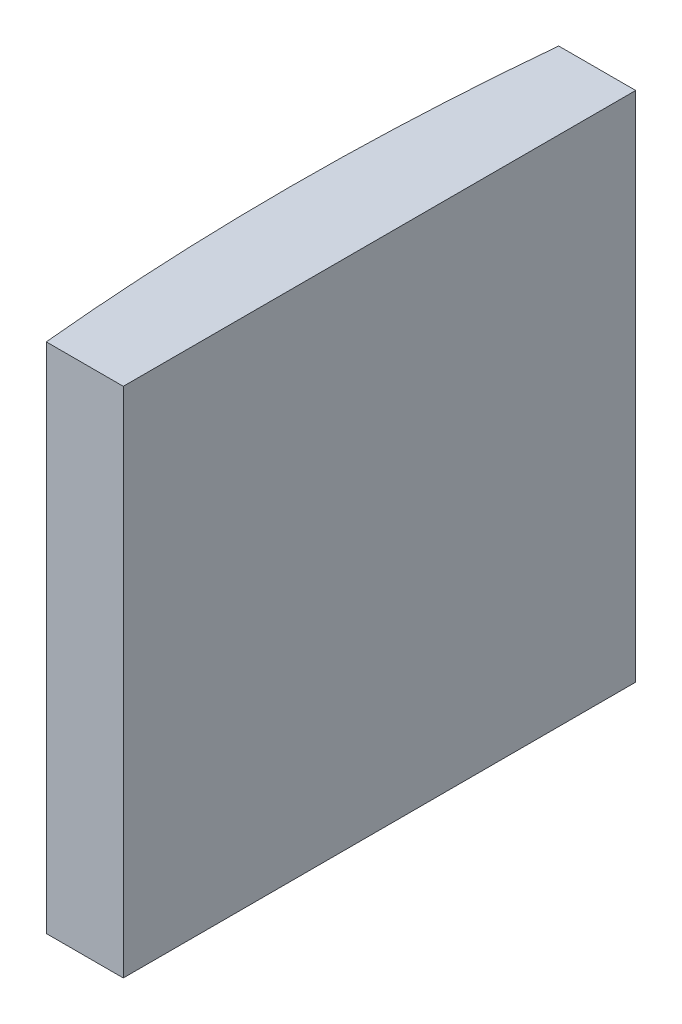
ISO-10303-21;
HEADER;
FILE_DESCRIPTION(('STEP AP214'),'2;1');
FILE_NAME('part.step','',(''),(''),'','','');
FILE_SCHEMA(('AUTOMOTIVE_DESIGN { 1 0 10303 214 1 1 1 1 }'));
ENDSEC;
DATA;
#1=APPLICATION_CONTEXT('core data for automotive mechanical design processes');
#2=APPLICATION_PROTOCOL_DEFINITION('international standard','automotive_design',2000,#1);
#3=PRODUCT_CONTEXT('',#1,'mechanical');
#4=PRODUCT('Part','Part','',(#3));
#5=PRODUCT_RELATED_PRODUCT_CATEGORY('part','',(#4));
#6=PRODUCT_DEFINITION_FORMATION('','',#4);
#7=PRODUCT_DEFINITION_CONTEXT('part definition',#1,'design');
#8=PRODUCT_DEFINITION('design','',#6,#7);
#9=PRODUCT_DEFINITION_SHAPE('','',#8);
#10=(LENGTH_UNIT() NAMED_UNIT(*) SI_UNIT(.MILLI.,.METRE.));
#11=(NAMED_UNIT(*) PLANE_ANGLE_UNIT() SI_UNIT($,.RADIAN.));
#12=(NAMED_UNIT(*) SI_UNIT($,.STERADIAN.) SOLID_ANGLE_UNIT());
#13=UNCERTAINTY_MEASURE_WITH_UNIT(LENGTH_MEASURE(1.E-05),#10,'distance_accuracy_value','');
#14=(GEOMETRIC_REPRESENTATION_CONTEXT(3) GLOBAL_UNCERTAINTY_ASSIGNED_CONTEXT((#13)) GLOBAL_UNIT_ASSIGNED_CONTEXT((#10,
#11,#12)) REPRESENTATION_CONTEXT('',''));
#15=CARTESIAN_POINT('',(0.,0.,0.));
#16=DIRECTION('',(0.,0.,1.));
#17=DIRECTION('',(1.,0.,0.));
#18=AXIS2_PLACEMENT_3D('',#15,#16,#17);
#19=CARTESIAN_POINT('',(4.35520433485127,20.,0.));
#20=DIRECTION('',(0.,-1.,0.));
#21=DIRECTION('',(0.,0.,-1.));
#22=AXIS2_PLACEMENT_3D('',#19,#20,#21);
#23=CYLINDRICAL_SURFACE('',#22,103.4);
#24=CARTESIAN_POINT('',(4.35520433485127,0.,0.));
#25=DIRECTION('',(0.,1.,0.));
#26=DIRECTION('',(0.,0.,1.));
#27=AXIS2_PLACEMENT_3D('',#24,#25,#26);
#28=CIRCLE('',#27,103.4);
#29=CARTESIAN_POINT('',(-98.560100649393,0.,-10.));
#30=VERTEX_POINT('',#29);
#31=CARTESIAN_POINT('',(-98.560100649393,0.,10.));
#32=VERTEX_POINT('',#31);
#33=EDGE_CURVE('E100',#30,#32,#28,.T.);
#34=ORIENTED_EDGE('',*,*,#33,.T.);
#35=DIRECTION('',(0.,-1.,0.));
#36=VECTOR('',#35,1.);
#37=CARTESIAN_POINT('',(-98.560100649393,20.,10.));
#38=LINE('',#37,#36);
#39=CARTESIAN_POINT('',(-98.560100649393,20.,10.));
#40=VERTEX_POINT('',#39);
#41=EDGE_CURVE('E11',#40,#32,#38,.T.);
#42=ORIENTED_EDGE('',*,*,#41,.F.);
#43=CARTESIAN_POINT('',(4.35520433485127,20.,0.));
#44=DIRECTION('',(0.,1.,0.));
#45=DIRECTION('',(0.,0.,1.));
#46=AXIS2_PLACEMENT_3D('',#43,#44,#45);
#47=CIRCLE('',#46,103.4);
#48=CARTESIAN_POINT('',(-98.560100649393,20.,-10.));
#49=VERTEX_POINT('',#48);
#50=EDGE_CURVE('E88',#49,#40,#47,.T.);
#51=ORIENTED_EDGE('',*,*,#50,.F.);
#52=DIRECTION('',(0.,-1.,0.));
#53=VECTOR('',#52,1.);
#54=CARTESIAN_POINT('',(-98.560100649393,20.,-10.));
#55=LINE('',#54,#53);
#56=EDGE_CURVE('E96',#49,#30,#55,.T.);
#57=ORIENTED_EDGE('',*,*,#56,.T.);
#58=EDGE_LOOP('',(#34,#42,#51,#57));
#59=FACE_BOUND('',#58,.T.);
#60=ADVANCED_FACE('F37',(#59),#23,.T.);
#61=CARTESIAN_POINT('',(-98.560100649393,20.,10.));
#62=DIRECTION('',(0.,0.,-1.));
#63=DIRECTION('',(-1.,0.,0.));
#64=AXIS2_PLACEMENT_3D('',#61,#62,#63);
#65=PLANE('',#64);
#66=DIRECTION('',(1.,0.,0.));
#67=VECTOR('',#66,1.);
#68=CARTESIAN_POINT('',(-98.560100649393,0.,10.));
#69=LINE('',#68,#67);
#70=CARTESIAN_POINT('',(-95.5547956651487,0.,10.));
#71=VERTEX_POINT('',#70);
#72=EDGE_CURVE('E92',#32,#71,#69,.T.);
#73=ORIENTED_EDGE('',*,*,#72,.T.);
#74=DIRECTION('',(0.,-1.,0.));
#75=VECTOR('',#74,1.);
#76=CARTESIAN_POINT('',(-95.5547956651487,20.,10.));
#77=LINE('',#76,#75);
#78=CARTESIAN_POINT('',(-95.5547956651487,20.,10.));
#79=VERTEX_POINT('',#78);
#80=EDGE_CURVE('E45',#79,#71,#77,.T.);
#81=ORIENTED_EDGE('',*,*,#80,.F.);
#82=DIRECTION('',(1.,0.,0.));
#83=VECTOR('',#82,1.);
#84=CARTESIAN_POINT('',(-98.560100649393,20.,10.));
#85=LINE('',#84,#83);
#86=EDGE_CURVE('E83',#40,#79,#85,.T.);
#87=ORIENTED_EDGE('',*,*,#86,.F.);
#88=ORIENTED_EDGE('',*,*,#41,.T.);
#89=EDGE_LOOP('',(#73,#81,#87,#88));
#90=FACE_BOUND('',#89,.T.);
#91=ADVANCED_FACE('F91',(#90),#65,.F.);
#92=CARTESIAN_POINT('',(-95.5547956651487,20.,-9.99999999999999));
#93=DIRECTION('',(-1.,0.,0.));
#94=DIRECTION('',(0.,0.,1.));
#95=AXIS2_PLACEMENT_3D('',#92,#93,#94);
#96=PLANE('',#95);
#97=DIRECTION('',(0.,0.,-1.));
#98=VECTOR('',#97,1.);
#99=CARTESIAN_POINT('',(-95.5547956651487,0.,-9.99999999999999));
#100=LINE('',#99,#98);
#101=CARTESIAN_POINT('',(-95.5547956651487,0.,-9.99999999999999));
#102=VERTEX_POINT('',#101);
#103=EDGE_CURVE('E70',#71,#102,#100,.T.);
#104=ORIENTED_EDGE('',*,*,#103,.T.);
#105=DIRECTION('',(0.,-1.,0.));
#106=VECTOR('',#105,1.);
#107=CARTESIAN_POINT('',(-95.5547956651487,20.,-9.99999999999999));
#108=LINE('',#107,#106);
#109=CARTESIAN_POINT('',(-95.5547956651487,20.,-9.99999999999999));
#110=VERTEX_POINT('',#109);
#111=EDGE_CURVE('E93',#110,#102,#108,.T.);
#112=ORIENTED_EDGE('',*,*,#111,.F.);
#113=DIRECTION('',(0.,0.,-1.));
#114=VECTOR('',#113,1.);
#115=CARTESIAN_POINT('',(-95.5547956651487,20.,-9.99999999999999));
#116=LINE('',#115,#114);
#117=EDGE_CURVE('E86',#79,#110,#116,.T.);
#118=ORIENTED_EDGE('',*,*,#117,.F.);
#119=ORIENTED_EDGE('',*,*,#80,.T.);
#120=EDGE_LOOP('',(#104,#112,#118,#119));
#121=FACE_BOUND('',#120,.T.);
#122=ADVANCED_FACE('F94',(#121),#96,.F.);
#123=CARTESIAN_POINT('',(-98.560100649393,20.,-10.));
#124=DIRECTION('',(0.,0.,1.));
#125=DIRECTION('',(1.,0.,0.));
#126=AXIS2_PLACEMENT_3D('',#123,#124,#125);
#127=PLANE('',#126);
#128=DIRECTION('',(-1.,0.,0.));
#129=VECTOR('',#128,1.);
#130=CARTESIAN_POINT('',(-98.560100649393,0.,-10.));
#131=LINE('',#130,#129);
#132=EDGE_CURVE('E76',#102,#30,#131,.T.);
#133=ORIENTED_EDGE('',*,*,#132,.T.);
#134=ORIENTED_EDGE('',*,*,#56,.F.);
#135=DIRECTION('',(-1.,0.,0.));
#136=VECTOR('',#135,1.);
#137=CARTESIAN_POINT('',(-98.560100649393,20.,-10.));
#138=LINE('',#137,#136);
#139=EDGE_CURVE('E53',#110,#49,#138,.T.);
#140=ORIENTED_EDGE('',*,*,#139,.F.);
#141=ORIENTED_EDGE('',*,*,#111,.T.);
#142=EDGE_LOOP('',(#133,#134,#140,#141));
#143=FACE_BOUND('',#142,.T.);
#144=ADVANCED_FACE('F107',(#143),#127,.F.);
#145=CARTESIAN_POINT('',(4.35520433485127,20.,0.));
#146=DIRECTION('',(0.,1.,0.));
#147=DIRECTION('',(0.,0.,1.));
#148=AXIS2_PLACEMENT_3D('',#145,#146,#147);
#149=PLANE('',#148);
#150=ORIENTED_EDGE('',*,*,#50,.T.);
#151=ORIENTED_EDGE('',*,*,#86,.T.);
#152=ORIENTED_EDGE('',*,*,#117,.T.);
#153=ORIENTED_EDGE('',*,*,#139,.T.);
#154=EDGE_LOOP('',(#150,#151,#152,#153));
#155=FACE_BOUND('',#154,.T.);
#156=ADVANCED_FACE('F84',(#155),#149,.T.);
#157=CARTESIAN_POINT('',(4.35520433485127,0.,0.));
#158=DIRECTION('',(0.,1.,0.));
#159=DIRECTION('',(0.,0.,1.));
#160=AXIS2_PLACEMENT_3D('',#157,#158,#159);
#161=PLANE('',#160);
#162=ORIENTED_EDGE('',*,*,#33,.F.);
#163=ORIENTED_EDGE('',*,*,#132,.F.);
#164=ORIENTED_EDGE('',*,*,#103,.F.);
#165=ORIENTED_EDGE('',*,*,#72,.F.);
#166=EDGE_LOOP('',(#162,#163,#164,#165));
#167=FACE_BOUND('',#166,.T.);
#168=ADVANCED_FACE('F110',(#167),#161,.F.);
#169=CLOSED_SHELL('',(#60,#91,#122,#144,#156,#168));
#170=MANIFOLD_SOLID_BREP('B2',#169);
#171=ADVANCED_BREP_SHAPE_REPRESENTATION('',(#18,#170),#14);
#172=SHAPE_DEFINITION_REPRESENTATION(#9,#171);
ENDSEC;
END-ISO-10303-21;
